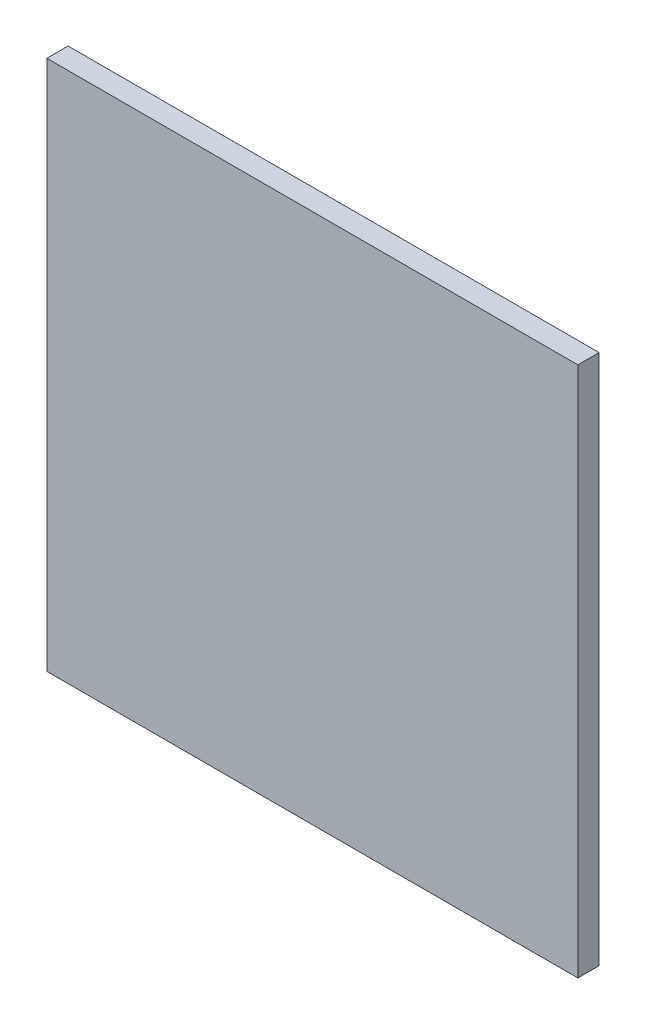
ISO-10303-21;
HEADER;
FILE_DESCRIPTION(('STEP AP214'),'2;1');
FILE_NAME('part.step','',(''),(''),'','','');
FILE_SCHEMA(('AUTOMOTIVE_DESIGN { 1 0 10303 214 1 1 1 1 }'));
ENDSEC;
DATA;
#1=APPLICATION_CONTEXT('core data for automotive mechanical design processes');
#2=APPLICATION_PROTOCOL_DEFINITION('international standard','automotive_design',2000,#1);
#3=PRODUCT_CONTEXT('',#1,'mechanical');
#4=PRODUCT('Part','Part','',(#3));
#5=PRODUCT_RELATED_PRODUCT_CATEGORY('part','',(#4));
#6=PRODUCT_DEFINITION_FORMATION('','',#4);
#7=PRODUCT_DEFINITION_CONTEXT('part definition',#1,'design');
#8=PRODUCT_DEFINITION('design','',#6,#7);
#9=PRODUCT_DEFINITION_SHAPE('','',#8);
#10=(LENGTH_UNIT() NAMED_UNIT(*) SI_UNIT(.MILLI.,.METRE.));
#11=(NAMED_UNIT(*) PLANE_ANGLE_UNIT() SI_UNIT($,.RADIAN.));
#12=(NAMED_UNIT(*) SI_UNIT($,.STERADIAN.) SOLID_ANGLE_UNIT());
#13=UNCERTAINTY_MEASURE_WITH_UNIT(LENGTH_MEASURE(1.E-05),#10,'distance_accuracy_value','');
#14=(GEOMETRIC_REPRESENTATION_CONTEXT(3) GLOBAL_UNCERTAINTY_ASSIGNED_CONTEXT((#13)) GLOBAL_UNIT_ASSIGNED_CONTEXT((#10,
#11,#12)) REPRESENTATION_CONTEXT('',''));
#15=CARTESIAN_POINT('',(0.,0.,0.));
#16=DIRECTION('',(0.,0.,1.));
#17=DIRECTION('',(1.,0.,0.));
#18=AXIS2_PLACEMENT_3D('',#15,#16,#17);
#19=CARTESIAN_POINT('',(-250.,-250.,20.));
#20=DIRECTION('',(1.,0.,0.));
#21=DIRECTION('',(0.,0.,-1.));
#22=AXIS2_PLACEMENT_3D('',#19,#20,#21);
#23=PLANE('',#22);
#24=DIRECTION('',(0.,-1.,0.));
#25=VECTOR('',#24,1.);
#26=CARTESIAN_POINT('',(-250.,-250.,0.));
#27=LINE('',#26,#25);
#28=CARTESIAN_POINT('',(-250.,250.,0.));
#29=VERTEX_POINT('',#28);
#30=CARTESIAN_POINT('',(-250.,-250.,0.));
#31=VERTEX_POINT('',#30);
#32=EDGE_CURVE('E96',#29,#31,#27,.T.);
#33=ORIENTED_EDGE('',*,*,#32,.T.);
#34=DIRECTION('',(0.,0.,-1.));
#35=VECTOR('',#34,1.);
#36=CARTESIAN_POINT('',(-250.,-250.,20.));
#37=LINE('',#36,#35);
#38=CARTESIAN_POINT('',(-250.,-250.,20.));
#39=VERTEX_POINT('',#38);
#40=EDGE_CURVE('E11',#39,#31,#37,.T.);
#41=ORIENTED_EDGE('',*,*,#40,.F.);
#42=DIRECTION('',(0.,-1.,0.));
#43=VECTOR('',#42,1.);
#44=CARTESIAN_POINT('',(-250.,-250.,20.));
#45=LINE('',#44,#43);
#46=CARTESIAN_POINT('',(-250.,250.,20.));
#47=VERTEX_POINT('',#46);
#48=EDGE_CURVE('E84',#47,#39,#45,.T.);
#49=ORIENTED_EDGE('',*,*,#48,.F.);
#50=DIRECTION('',(0.,0.,-1.));
#51=VECTOR('',#50,1.);
#52=CARTESIAN_POINT('',(-250.,250.,20.));
#53=LINE('',#52,#51);
#54=EDGE_CURVE('E92',#47,#29,#53,.T.);
#55=ORIENTED_EDGE('',*,*,#54,.T.);
#56=EDGE_LOOP('',(#33,#41,#49,#55));
#57=FACE_BOUND('',#56,.T.);
#58=ADVANCED_FACE('F33',(#57),#23,.F.);
#59=CARTESIAN_POINT('',(250.,-250.,20.));
#60=DIRECTION('',(0.,1.,0.));
#61=DIRECTION('',(-1.,0.,0.));
#62=AXIS2_PLACEMENT_3D('',#59,#60,#61);
#63=PLANE('',#62);
#64=DIRECTION('',(1.,0.,0.));
#65=VECTOR('',#64,1.);
#66=CARTESIAN_POINT('',(250.,-250.,0.));
#67=LINE('',#66,#65);
#68=CARTESIAN_POINT('',(250.,-250.,0.));
#69=VERTEX_POINT('',#68);
#70=EDGE_CURVE('E88',#31,#69,#67,.T.);
#71=ORIENTED_EDGE('',*,*,#70,.T.);
#72=DIRECTION('',(0.,0.,-1.));
#73=VECTOR('',#72,1.);
#74=CARTESIAN_POINT('',(250.,-250.,20.));
#75=LINE('',#74,#73);
#76=CARTESIAN_POINT('',(250.,-250.,20.));
#77=VERTEX_POINT('',#76);
#78=EDGE_CURVE('E41',#77,#69,#75,.T.);
#79=ORIENTED_EDGE('',*,*,#78,.F.);
#80=DIRECTION('',(1.,0.,0.));
#81=VECTOR('',#80,1.);
#82=CARTESIAN_POINT('',(250.,-250.,20.));
#83=LINE('',#82,#81);
#84=EDGE_CURVE('E79',#39,#77,#83,.T.);
#85=ORIENTED_EDGE('',*,*,#84,.F.);
#86=ORIENTED_EDGE('',*,*,#40,.T.);
#87=EDGE_LOOP('',(#71,#79,#85,#86));
#88=FACE_BOUND('',#87,.T.);
#89=ADVANCED_FACE('F87',(#88),#63,.F.);
#90=CARTESIAN_POINT('',(250.,-250.,20.));
#91=DIRECTION('',(-1.,0.,0.));
#92=DIRECTION('',(0.,0.,1.));
#93=AXIS2_PLACEMENT_3D('',#90,#91,#92);
#94=PLANE('',#93);
#95=DIRECTION('',(0.,1.,0.));
#96=VECTOR('',#95,1.);
#97=CARTESIAN_POINT('',(250.,-250.,0.));
#98=LINE('',#97,#96);
#99=CARTESIAN_POINT('',(250.,250.,0.));
#100=VERTEX_POINT('',#99);
#101=EDGE_CURVE('E66',#69,#100,#98,.T.);
#102=ORIENTED_EDGE('',*,*,#101,.T.);
#103=DIRECTION('',(0.,0.,-1.));
#104=VECTOR('',#103,1.);
#105=CARTESIAN_POINT('',(250.,250.,20.));
#106=LINE('',#105,#104);
#107=CARTESIAN_POINT('',(250.,250.,20.));
#108=VERTEX_POINT('',#107);
#109=EDGE_CURVE('E89',#108,#100,#106,.T.);
#110=ORIENTED_EDGE('',*,*,#109,.F.);
#111=DIRECTION('',(0.,1.,0.));
#112=VECTOR('',#111,1.);
#113=CARTESIAN_POINT('',(250.,-250.,20.));
#114=LINE('',#113,#112);
#115=EDGE_CURVE('E82',#77,#108,#114,.T.);
#116=ORIENTED_EDGE('',*,*,#115,.F.);
#117=ORIENTED_EDGE('',*,*,#78,.T.);
#118=EDGE_LOOP('',(#102,#110,#116,#117));
#119=FACE_BOUND('',#118,.T.);
#120=ADVANCED_FACE('F90',(#119),#94,.F.);
#121=CARTESIAN_POINT('',(250.,250.,20.));
#122=DIRECTION('',(0.,-1.,0.));
#123=DIRECTION('',(1.,0.,0.));
#124=AXIS2_PLACEMENT_3D('',#121,#122,#123);
#125=PLANE('',#124);
#126=DIRECTION('',(-1.,0.,0.));
#127=VECTOR('',#126,1.);
#128=CARTESIAN_POINT('',(250.,250.,0.));
#129=LINE('',#128,#127);
#130=EDGE_CURVE('E72',#100,#29,#129,.T.);
#131=ORIENTED_EDGE('',*,*,#130,.T.);
#132=ORIENTED_EDGE('',*,*,#54,.F.);
#133=DIRECTION('',(-1.,0.,0.));
#134=VECTOR('',#133,1.);
#135=CARTESIAN_POINT('',(250.,250.,20.));
#136=LINE('',#135,#134);
#137=EDGE_CURVE('E49',#108,#47,#136,.T.);
#138=ORIENTED_EDGE('',*,*,#137,.F.);
#139=ORIENTED_EDGE('',*,*,#109,.T.);
#140=EDGE_LOOP('',(#131,#132,#138,#139));
#141=FACE_BOUND('',#140,.T.);
#142=ADVANCED_FACE('F103',(#141),#125,.F.);
#143=CARTESIAN_POINT('',(0.,0.,20.));
#144=DIRECTION('',(0.,0.,1.));
#145=DIRECTION('',(1.,0.,0.));
#146=AXIS2_PLACEMENT_3D('',#143,#144,#145);
#147=PLANE('',#146);
#148=ORIENTED_EDGE('',*,*,#48,.T.);
#149=ORIENTED_EDGE('',*,*,#84,.T.);
#150=ORIENTED_EDGE('',*,*,#115,.T.);
#151=ORIENTED_EDGE('',*,*,#137,.T.);
#152=EDGE_LOOP('',(#148,#149,#150,#151));
#153=FACE_BOUND('',#152,.T.);
#154=ADVANCED_FACE('F80',(#153),#147,.T.);
#155=CARTESIAN_POINT('',(0.,0.,0.));
#156=DIRECTION('',(0.,0.,1.));
#157=DIRECTION('',(1.,0.,0.));
#158=AXIS2_PLACEMENT_3D('',#155,#156,#157);
#159=PLANE('',#158);
#160=ORIENTED_EDGE('',*,*,#32,.F.);
#161=ORIENTED_EDGE('',*,*,#130,.F.);
#162=ORIENTED_EDGE('',*,*,#101,.F.);
#163=ORIENTED_EDGE('',*,*,#70,.F.);
#164=EDGE_LOOP('',(#160,#161,#162,#163));
#165=FACE_BOUND('',#164,.T.);
#166=ADVANCED_FACE('F106',(#165),#159,.F.);
#167=CLOSED_SHELL('',(#58,#89,#120,#142,#154,#166));
#168=MANIFOLD_SOLID_BREP('B2',#167);
#169=ADVANCED_BREP_SHAPE_REPRESENTATION('',(#18,#168),#14);
#170=SHAPE_DEFINITION_REPRESENTATION(#9,#169);
ENDSEC;
END-ISO-10303-21;
